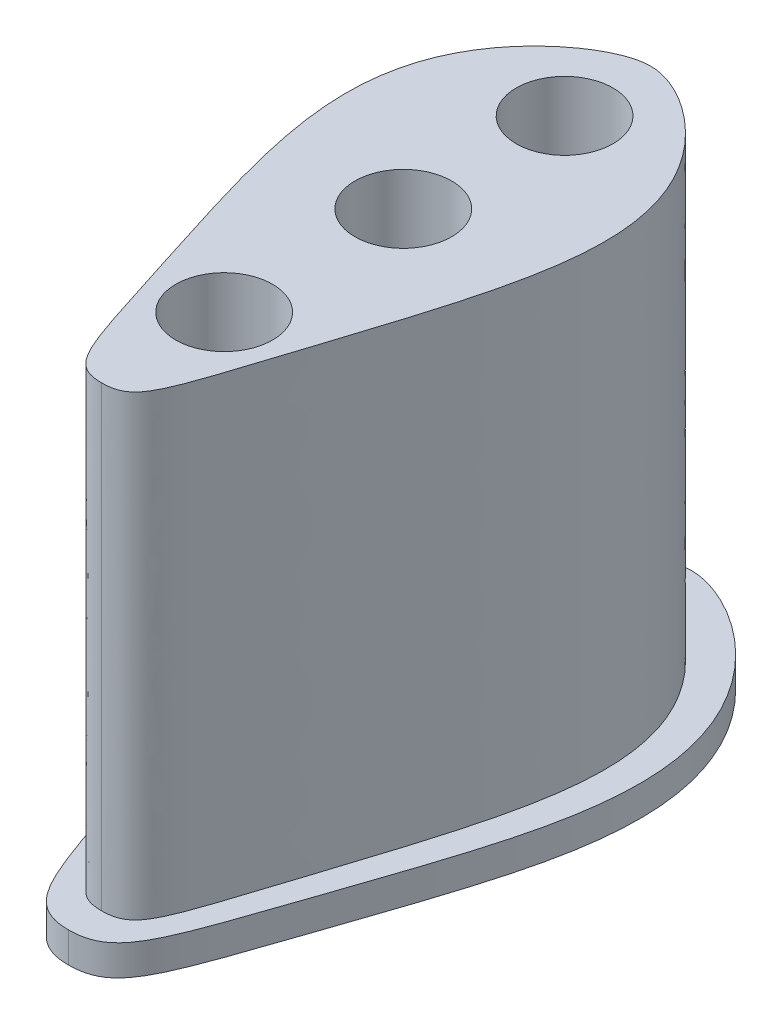
ISO-10303-21;
HEADER;
FILE_DESCRIPTION(('STEP AP214'),'2;1');
FILE_NAME('part.step','',(''),(''),'','','');
FILE_SCHEMA(('AUTOMOTIVE_DESIGN { 1 0 10303 214 1 1 1 1 }'));
ENDSEC;
DATA;
#1=APPLICATION_CONTEXT('core data for automotive mechanical design processes');
#2=APPLICATION_PROTOCOL_DEFINITION('international standard','automotive_design',2000,#1);
#3=PRODUCT_CONTEXT('',#1,'mechanical');
#4=PRODUCT('Part','Part','',(#3));
#5=PRODUCT_RELATED_PRODUCT_CATEGORY('part','',(#4));
#6=PRODUCT_DEFINITION_FORMATION('','',#4);
#7=PRODUCT_DEFINITION_CONTEXT('part definition',#1,'design');
#8=PRODUCT_DEFINITION('design','',#6,#7);
#9=PRODUCT_DEFINITION_SHAPE('','',#8);
#10=(LENGTH_UNIT() NAMED_UNIT(*) SI_UNIT(.MILLI.,.METRE.));
#11=(NAMED_UNIT(*) PLANE_ANGLE_UNIT() SI_UNIT($,.RADIAN.));
#12=(NAMED_UNIT(*) SI_UNIT($,.STERADIAN.) SOLID_ANGLE_UNIT());
#13=UNCERTAINTY_MEASURE_WITH_UNIT(LENGTH_MEASURE(1.E-05),#10,'distance_accuracy_value','');
#14=(GEOMETRIC_REPRESENTATION_CONTEXT(3) GLOBAL_UNCERTAINTY_ASSIGNED_CONTEXT((#13)) GLOBAL_UNIT_ASSIGNED_CONTEXT((#10,
#11,#12)) REPRESENTATION_CONTEXT('',''));
#15=CARTESIAN_POINT('',(0.,0.,0.));
#16=DIRECTION('',(0.,0.,1.));
#17=DIRECTION('',(1.,0.,0.));
#18=AXIS2_PLACEMENT_3D('',#15,#16,#17);
#19=CARTESIAN_POINT('',(0.12286504058619,32.,-38.2384665260502));
#20=CARTESIAN_POINT('',(-4.97587389575558,32.,-38.2414873686948));
#21=CARTESIAN_POINT('',(-13.5003142261998,32.,-27.3530555676864));
#22=CARTESIAN_POINT('',(-10.5685583705486,32.,-26.1997976414068));
#23=CARTESIAN_POINT('',(-0.852682464661893,32.,-7.55709148616971));
#24=CARTESIAN_POINT('',(-4.49606017056606,32.,-2.23526174369485));
#25=CARTESIAN_POINT('',(0.101532658938724,32.,-2.23253781437521));
#26=B_SPLINE_CURVE_WITH_KNOTS('',6,(#19,#20,#21,#22,#23,#24,#25),.UNSPECIFIED.,.F.,.F.,(7,7),
(0.,1.),.UNSPECIFIED.);
#27=DIRECTION('',(0.,-1.,0.));
#28=VECTOR('',#27,1.);
#29=SURFACE_OF_LINEAR_EXTRUSION('',#26,#28);
#30=DIRECTION('',(0.,-1.,0.));
#31=VECTOR('',#30,1.);
#32=CARTESIAN_POINT('',(0.122865040586191,32.,-38.2384665260502));
#33=LINE('',#32,#31);
#34=CARTESIAN_POINT('',(0.122865040586191,32.,-38.2384665260502));
#35=VERTEX_POINT('',#34);
#36=CARTESIAN_POINT('',(0.122865040586191,2.,-38.2384665260502));
#37=VERTEX_POINT('',#36);
#38=EDGE_CURVE('E52',#35,#37,#33,.T.);
#39=ORIENTED_EDGE('',*,*,#38,.T.);
#40=CARTESIAN_POINT('',(0.12286504058619,2.,-38.2384665260502));
#41=CARTESIAN_POINT('',(-4.97587389575558,2.,-38.2414873686948));
#42=CARTESIAN_POINT('',(-13.5003142261998,2.,-27.3530555676864));
#43=CARTESIAN_POINT('',(-10.5685583705486,2.,-26.1997976414068));
#44=CARTESIAN_POINT('',(-0.852682464661893,2.,-7.55709148616971));
#45=CARTESIAN_POINT('',(-4.49606017056606,2.,-2.23526174369485));
#46=CARTESIAN_POINT('',(0.101532658938724,2.,-2.23253781437521));
#47=B_SPLINE_CURVE_WITH_KNOTS('',6,(#40,#41,#42,#43,#44,#45,#46),.UNSPECIFIED.,.F.,.F.,(7,7),
(0.,1.),.UNSPECIFIED.);
#48=CARTESIAN_POINT('',(0.101532658938724,2.,-2.23253781437521));
#49=VERTEX_POINT('',#48);
#50=EDGE_CURVE('E86',#37,#49,#47,.T.);
#51=ORIENTED_EDGE('',*,*,#50,.T.);
#52=DIRECTION('',(0.,-1.,0.));
#53=VECTOR('',#52,1.);
#54=CARTESIAN_POINT('',(0.101532658938724,32.,-2.23253781437521));
#55=LINE('',#54,#53);
#56=CARTESIAN_POINT('',(0.101532658938724,32.,-2.23253781437521));
#57=VERTEX_POINT('',#56);
#58=EDGE_CURVE('E11',#57,#49,#55,.T.);
#59=ORIENTED_EDGE('',*,*,#58,.F.);
#60=EDGE_CURVE('E151',#35,#57,#26,.T.);
#61=ORIENTED_EDGE('',*,*,#60,.F.);
#62=EDGE_LOOP('',(#39,#51,#59,#61));
#63=FACE_BOUND('',#62,.T.);
#64=ADVANCED_FACE('F43',(#63),#29,.F.);
#65=CARTESIAN_POINT('',(0.106293025062344,32.,-10.2673370281271));
#66=DIRECTION('',(0.,-1.,0.));
#67=DIRECTION('',(0.,0.,-1.));
#68=AXIS2_PLACEMENT_3D('',#65,#66,#67);
#69=CYLINDRICAL_SURFACE('',#68,3.175);
#70=CARTESIAN_POINT('',(0.106293025062344,32.,-10.2673370281271));
#71=DIRECTION('',(0.,1.,0.));
#72=DIRECTION('',(0.,0.,1.));
#73=AXIS2_PLACEMENT_3D('',#70,#71,#72);
#74=CIRCLE('',#73,3.175);
#75=CARTESIAN_POINT('',(0.106293025062344,32.,-7.09233702812706));
#76=VERTEX_POINT('',#75);
#77=EDGE_CURVE('E150',#76,#76,#74,.T.);
#78=ORIENTED_EDGE('',*,*,#77,.T.);
#79=EDGE_LOOP('',(#78));
#80=FACE_BOUND('',#79,.T.);
#81=CARTESIAN_POINT('',(0.106293025062344,0.,-10.2673370281271));
#82=DIRECTION('',(0.,1.,0.));
#83=DIRECTION('',(0.,0.,1.));
#84=AXIS2_PLACEMENT_3D('',#81,#82,#83);
#85=CIRCLE('',#84,3.175);
#86=CARTESIAN_POINT('',(0.106293025062344,0.,-7.09233702812706));
#87=VERTEX_POINT('',#86);
#88=EDGE_CURVE('E170',#87,#87,#85,.T.);
#89=ORIENTED_EDGE('',*,*,#88,.F.);
#90=EDGE_LOOP('',(#89));
#91=FACE_BOUND('',#90,.T.);
#92=ADVANCED_FACE('F138',(#80,#91),#69,.F.);
#93=CARTESIAN_POINT('',(0.12286504058619,32.,-38.2384665260502));
#94=CARTESIAN_POINT('',(5.22160397692796,32.,-38.2354456834056));
#95=CARTESIAN_POINT('',(13.7331362198504,32.,-27.3369206038269));
#96=CARTESIAN_POINT('',(10.8000158846981,32.,-26.1871374324472));
#97=CARTESIAN_POINT('',(1.06205637199252,32.,-7.55595706355988));
#98=CARTESIAN_POINT('',(4.69912548844351,32.,-2.22981388505557));
#99=CARTESIAN_POINT('',(0.101532658938724,32.,-2.23253781437521));
#100=B_SPLINE_CURVE_WITH_KNOTS('',6,(#93,#94,#95,#96,#97,#98,#99),.UNSPECIFIED.,.F.,.F.,(7,7),
(0.,1.),.UNSPECIFIED.);
#101=DIRECTION('',(0.,-1.,0.));
#102=VECTOR('',#101,1.);
#103=SURFACE_OF_LINEAR_EXTRUSION('',#100,#102);
#104=CARTESIAN_POINT('',(0.12286504058619,2.,-38.2384665260502));
#105=CARTESIAN_POINT('',(5.22160397692796,2.,-38.2354456834056));
#106=CARTESIAN_POINT('',(13.7331362198504,2.,-27.3369206038269));
#107=CARTESIAN_POINT('',(10.8000158846981,2.,-26.1871374324472));
#108=CARTESIAN_POINT('',(1.06205637199252,2.,-7.55595706355988));
#109=CARTESIAN_POINT('',(4.69912548844351,2.,-2.22981388505557));
#110=CARTESIAN_POINT('',(0.101532658938724,2.,-2.23253781437521));
#111=B_SPLINE_CURVE_WITH_KNOTS('',6,(#104,#105,#106,#107,#108,#109,#110),.UNSPECIFIED.,.F.,.F.,
(7,7),(0.,1.),.UNSPECIFIED.);
#112=EDGE_CURVE('E58',#37,#49,#111,.T.);
#113=ORIENTED_EDGE('',*,*,#112,.F.);
#114=ORIENTED_EDGE('',*,*,#38,.F.);
#115=EDGE_CURVE('E83',#35,#57,#100,.T.);
#116=ORIENTED_EDGE('',*,*,#115,.T.);
#117=ORIENTED_EDGE('',*,*,#58,.T.);
#118=EDGE_LOOP('',(#113,#114,#116,#117));
#119=FACE_BOUND('',#118,.T.);
#120=ADVANCED_FACE('F81',(#119),#103,.T.);
#121=CARTESIAN_POINT('',(0.119516457624504,32.,-32.5865500454572));
#122=DIRECTION('',(0.,-1.,0.));
#123=DIRECTION('',(0.,0.,-1.));
#124=AXIS2_PLACEMENT_3D('',#121,#122,#123);
#125=CYLINDRICAL_SURFACE('',#124,3.175);
#126=CARTESIAN_POINT('',(0.119516457624504,32.,-32.5865500454572));
#127=DIRECTION('',(0.,1.,0.));
#128=DIRECTION('',(0.,0.,1.));
#129=AXIS2_PLACEMENT_3D('',#126,#127,#128);
#130=CIRCLE('',#129,3.175);
#131=CARTESIAN_POINT('',(0.119516457624504,32.,-29.4115500454572));
#132=VERTEX_POINT('',#131);
#133=EDGE_CURVE('E178',#132,#132,#130,.T.);
#134=ORIENTED_EDGE('',*,*,#133,.T.);
#135=EDGE_LOOP('',(#134));
#136=FACE_BOUND('',#135,.T.);
#137=CARTESIAN_POINT('',(0.119516457624504,0.,-32.5865500454572));
#138=DIRECTION('',(0.,1.,0.));
#139=DIRECTION('',(0.,0.,1.));
#140=AXIS2_PLACEMENT_3D('',#137,#138,#139);
#141=CIRCLE('',#140,3.175);
#142=CARTESIAN_POINT('',(0.119516457624504,0.,-29.4115500454572));
#143=VERTEX_POINT('',#142);
#144=EDGE_CURVE('E166',#143,#143,#141,.T.);
#145=ORIENTED_EDGE('',*,*,#144,.F.);
#146=EDGE_LOOP('',(#145));
#147=FACE_BOUND('',#146,.T.);
#148=ADVANCED_FACE('F45',(#136,#147),#125,.F.);
#149=CARTESIAN_POINT('',(0.113251364753859,32.,-22.0119929706604));
#150=DIRECTION('',(0.,-1.,0.));
#151=DIRECTION('',(0.,0.,-1.));
#152=AXIS2_PLACEMENT_3D('',#149,#150,#151);
#153=CYLINDRICAL_SURFACE('',#152,3.175);
#154=CARTESIAN_POINT('',(0.113251364753859,32.,-22.0119929706604));
#155=DIRECTION('',(0.,1.,0.));
#156=DIRECTION('',(0.,0.,1.));
#157=AXIS2_PLACEMENT_3D('',#154,#155,#156);
#158=CIRCLE('',#157,3.175);
#159=CARTESIAN_POINT('',(0.113251364753859,32.,-18.8369929706604));
#160=VERTEX_POINT('',#159);
#161=EDGE_CURVE('E162',#160,#160,#158,.T.);
#162=ORIENTED_EDGE('',*,*,#161,.T.);
#163=EDGE_LOOP('',(#162));
#164=FACE_BOUND('',#163,.T.);
#165=CARTESIAN_POINT('',(0.113251364753859,0.,-22.0119929706604));
#166=DIRECTION('',(0.,1.,0.));
#167=DIRECTION('',(0.,0.,1.));
#168=AXIS2_PLACEMENT_3D('',#165,#166,#167);
#169=CIRCLE('',#168,3.175);
#170=CARTESIAN_POINT('',(0.113251364753859,0.,-18.8369929706604));
#171=VERTEX_POINT('',#170);
#172=EDGE_CURVE('E175',#171,#171,#169,.T.);
#173=ORIENTED_EDGE('',*,*,#172,.F.);
#174=EDGE_LOOP('',(#173));
#175=FACE_BOUND('',#174,.T.);
#176=ADVANCED_FACE('F130',(#164,#175),#153,.F.);
#177=CARTESIAN_POINT('',(0.,32.,0.));
#178=DIRECTION('',(0.,1.,0.));
#179=DIRECTION('',(0.,0.,1.));
#180=AXIS2_PLACEMENT_3D('',#177,#178,#179);
#181=PLANE('',#180);
#182=ORIENTED_EDGE('',*,*,#133,.F.);
#183=EDGE_LOOP('',(#182));
#184=FACE_BOUND('',#183,.T.);
#185=ORIENTED_EDGE('',*,*,#60,.T.);
#186=ORIENTED_EDGE('',*,*,#115,.F.);
#187=EDGE_LOOP('',(#185,#186));
#188=FACE_BOUND('',#187,.T.);
#189=ORIENTED_EDGE('',*,*,#77,.F.);
#190=EDGE_LOOP('',(#189));
#191=FACE_BOUND('',#190,.T.);
#192=ORIENTED_EDGE('',*,*,#161,.F.);
#193=EDGE_LOOP('',(#192));
#194=FACE_BOUND('',#193,.T.);
#195=ADVANCED_FACE('F127',(#184,#188,#191,#194),#181,.T.);
#196=CARTESIAN_POINT('',(0.,0.,0.));
#197=DIRECTION('',(0.,1.,0.));
#198=DIRECTION('',(0.,0.,1.));
#199=AXIS2_PLACEMENT_3D('',#196,#197,#198);
#200=PLANE('',#199);
#201=ORIENTED_EDGE('',*,*,#144,.T.);
#202=EDGE_LOOP('',(#201));
#203=FACE_BOUND('',#202,.T.);
#204=ORIENTED_EDGE('',*,*,#88,.T.);
#205=EDGE_LOOP('',(#204));
#206=FACE_BOUND('',#205,.T.);
#207=ORIENTED_EDGE('',*,*,#172,.T.);
#208=EDGE_LOOP('',(#207));
#209=FACE_BOUND('',#208,.T.);
#210=CARTESIAN_POINT('',(0.124452183934537,0.,-40.917331511693));
#211=CARTESIAN_POINT('',(6.17279312322754,0.,-40.9137480596931));
#212=CARTESIAN_POINT('',(21.5830913649793,0.,-26.9680854606389));
#213=CARTESIAN_POINT('',(4.78498692354374,0.,-20.8059839368501));
#214=CARTESIAN_POINT('',(9.65095529307126,0.,-11.8158030364155));
#215=CARTESIAN_POINT('',(2.70130364402917,0.,-5.79162212799365));
#216=CARTESIAN_POINT('',(5.31185129578458,0.,-0.0637869915474992));
#217=CARTESIAN_POINT('',(0.100249571578134,0.,-0.0668747018483672));
#218=B_SPLINE_CURVE_WITH_KNOTS('',7,(#210,#211,#212,#213,#214,#215,#216,#217),.UNSPECIFIED.,.F.,
.F.,(8,8),(0.,1.),.UNSPECIFIED.);
#219=CARTESIAN_POINT('',(0.124452183934537,0.,-40.917331511693));
#220=VERTEX_POINT('',#219);
#221=CARTESIAN_POINT('',(0.100249571578134,0.,-0.0668747018483672));
#222=VERTEX_POINT('',#221);
#223=EDGE_CURVE('E197',#220,#222,#218,.T.);
#224=ORIENTED_EDGE('',*,*,#223,.T.);
#225=CARTESIAN_POINT('',(0.124452183934537,0.,-40.917331511693));
#226=CARTESIAN_POINT('',(-5.92388875535846,0.,-40.920914963693));
#227=CARTESIAN_POINT('',(-21.3507009066811,0.,-26.9935223838092));
#228=CARTESIAN_POINT('',(-4.55990995873176,0.,-20.8115204946861));
#229=CARTESIAN_POINT('',(-9.43652770794617,0.,-11.8271117704667));
#230=CARTESIAN_POINT('',(-2.49401921119781,0.,-5.79470019357605));
#231=CARTESIAN_POINT('',(-5.11135215262831,0.,-0.0699624121492358));
#232=CARTESIAN_POINT('',(0.100249571578134,0.,-0.0668747018483672));
#233=B_SPLINE_CURVE_WITH_KNOTS('',7,(#225,#226,#227,#228,#229,#230,#231,#232),.UNSPECIFIED.,.F.,
.F.,(8,8),(0.,1.),.UNSPECIFIED.);
#234=EDGE_CURVE('E89',#220,#222,#233,.T.);
#235=ORIENTED_EDGE('',*,*,#234,.F.);
#236=EDGE_LOOP('',(#224,#235));
#237=FACE_BOUND('',#236,.T.);
#238=ADVANCED_FACE('F124',(#203,#206,#209,#237),#200,.F.);
#239=CARTESIAN_POINT('',(0.124452183934537,2.,-40.917331511693));
#240=CARTESIAN_POINT('',(6.17279312322754,2.,-40.9137480596931));
#241=CARTESIAN_POINT('',(21.5830913649793,2.,-26.9680854606389));
#242=CARTESIAN_POINT('',(4.78498692354374,2.,-20.8059839368501));
#243=CARTESIAN_POINT('',(9.65095529307126,2.,-11.8158030364155));
#244=CARTESIAN_POINT('',(2.70130364402917,2.,-5.79162212799365));
#245=CARTESIAN_POINT('',(5.31185129578458,2.,-0.0637869915474992));
#246=CARTESIAN_POINT('',(0.100249571578134,2.,-0.0668747018483672));
#247=B_SPLINE_CURVE_WITH_KNOTS('',7,(#239,#240,#241,#242,#243,#244,#245,#246),.UNSPECIFIED.,.F.,
.F.,(8,8),(0.,1.),.UNSPECIFIED.);
#248=DIRECTION('',(0.,-1.,0.));
#249=VECTOR('',#248,1.);
#250=SURFACE_OF_LINEAR_EXTRUSION('',#247,#249);
#251=ORIENTED_EDGE('',*,*,#223,.F.);
#252=DIRECTION('',(0.,-1.,0.));
#253=VECTOR('',#252,1.);
#254=CARTESIAN_POINT('',(0.124452183934537,2.,-40.917331511693));
#255=LINE('',#254,#253);
#256=CARTESIAN_POINT('',(0.124452183934537,2.,-40.917331511693));
#257=VERTEX_POINT('',#256);
#258=EDGE_CURVE('E171',#257,#220,#255,.T.);
#259=ORIENTED_EDGE('',*,*,#258,.F.);
#260=CARTESIAN_POINT('',(0.100249571578134,2.,-0.0668747018483672));
#261=VERTEX_POINT('',#260);
#262=EDGE_CURVE('E94',#257,#261,#247,.T.);
#263=ORIENTED_EDGE('',*,*,#262,.T.);
#264=DIRECTION('',(0.,-1.,0.));
#265=VECTOR('',#264,1.);
#266=CARTESIAN_POINT('',(0.100249571578134,2.,-0.0668747018483672));
#267=LINE('',#266,#265);
#268=EDGE_CURVE('E185',#261,#222,#267,.T.);
#269=ORIENTED_EDGE('',*,*,#268,.T.);
#270=EDGE_LOOP('',(#251,#259,#263,#269));
#271=FACE_BOUND('',#270,.T.);
#272=ADVANCED_FACE('F119',(#271),#250,.T.);
#273=CARTESIAN_POINT('',(0.124452183934537,2.,-40.917331511693));
#274=CARTESIAN_POINT('',(-5.92388875535846,2.,-40.920914963693));
#275=CARTESIAN_POINT('',(-21.3507009066811,2.,-26.9935223838092));
#276=CARTESIAN_POINT('',(-4.55990995873176,2.,-20.8115204946861));
#277=CARTESIAN_POINT('',(-9.43652770794617,2.,-11.8271117704667));
#278=CARTESIAN_POINT('',(-2.49401921119781,2.,-5.79470019357605));
#279=CARTESIAN_POINT('',(-5.11135215262831,2.,-0.0699624121492358));
#280=CARTESIAN_POINT('',(0.100249571578134,2.,-0.0668747018483672));
#281=B_SPLINE_CURVE_WITH_KNOTS('',7,(#273,#274,#275,#276,#277,#278,#279,#280),.UNSPECIFIED.,.F.,
.F.,(8,8),(0.,1.),.UNSPECIFIED.);
#282=DIRECTION('',(0.,-1.,0.));
#283=VECTOR('',#282,1.);
#284=SURFACE_OF_LINEAR_EXTRUSION('',#281,#283);
#285=ORIENTED_EDGE('',*,*,#234,.T.);
#286=ORIENTED_EDGE('',*,*,#268,.F.);
#287=EDGE_CURVE('E98',#257,#261,#281,.T.);
#288=ORIENTED_EDGE('',*,*,#287,.F.);
#289=ORIENTED_EDGE('',*,*,#258,.T.);
#290=EDGE_LOOP('',(#285,#286,#288,#289));
#291=FACE_BOUND('',#290,.T.);
#292=ADVANCED_FACE('F123',(#291),#284,.F.);
#293=CARTESIAN_POINT('',(0.,2.,0.));
#294=DIRECTION('',(0.,1.,0.));
#295=DIRECTION('',(0.,0.,1.));
#296=AXIS2_PLACEMENT_3D('',#293,#294,#295);
#297=PLANE('',#296);
#298=ORIENTED_EDGE('',*,*,#50,.F.);
#299=ORIENTED_EDGE('',*,*,#112,.T.);
#300=EDGE_LOOP('',(#298,#299));
#301=FACE_BOUND('',#300,.T.);
#302=ORIENTED_EDGE('',*,*,#262,.F.);
#303=ORIENTED_EDGE('',*,*,#287,.T.);
#304=EDGE_LOOP('',(#302,#303));
#305=FACE_BOUND('',#304,.T.);
#306=ADVANCED_FACE('F91',(#301,#305),#297,.T.);
#307=CLOSED_SHELL('',(#64,#92,#120,#148,#176,#195,#238,#272,#292,#306));
#308=MANIFOLD_SOLID_BREP('B2',#307);
#309=ADVANCED_BREP_SHAPE_REPRESENTATION('',(#18,#308),#14);
#310=SHAPE_DEFINITION_REPRESENTATION(#9,#309);
ENDSEC;
END-ISO-10303-21;
